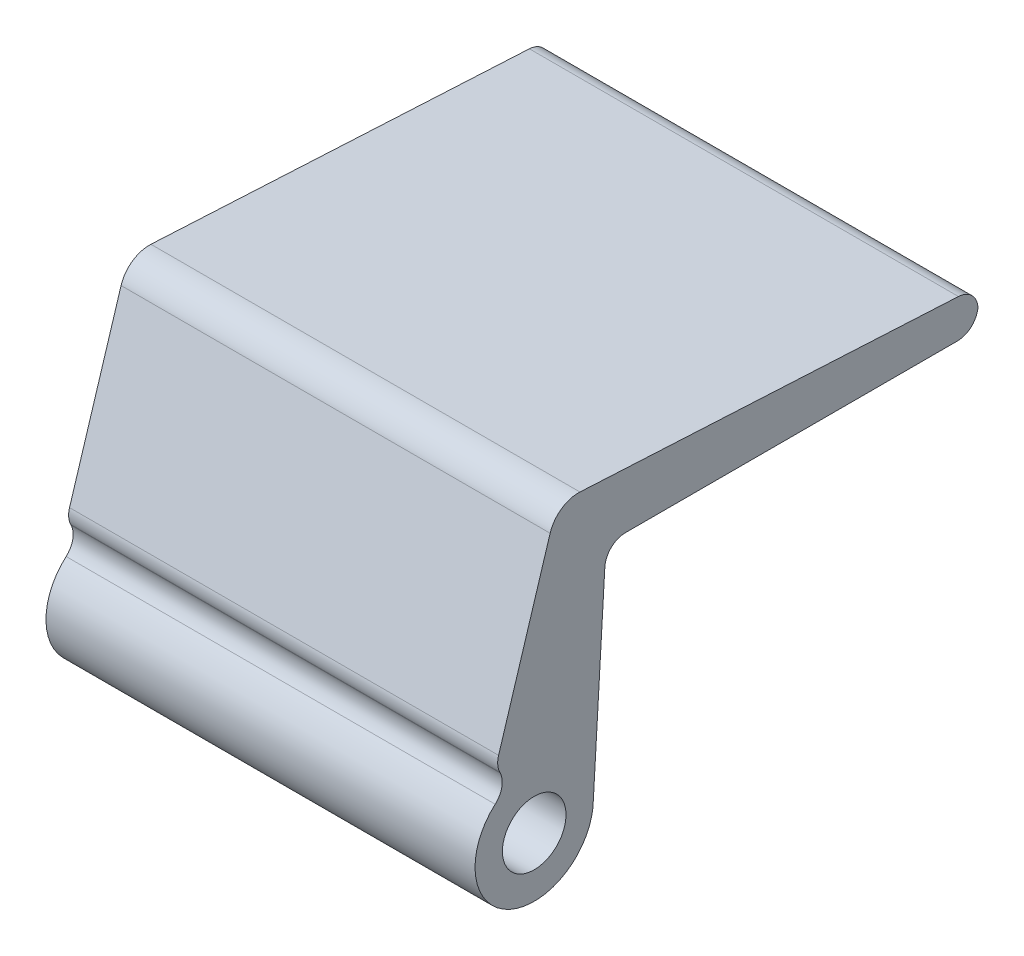
ISO-10303-21;
HEADER;
FILE_DESCRIPTION(('STEP AP214'),'2;1');
FILE_NAME('part.step','',(''),(''),'','','');
FILE_SCHEMA(('AUTOMOTIVE_DESIGN { 1 0 10303 214 1 1 1 1 }'));
ENDSEC;
DATA;
#1=APPLICATION_CONTEXT('core data for automotive mechanical design processes');
#2=APPLICATION_PROTOCOL_DEFINITION('international standard','automotive_design',2000,#1);
#3=PRODUCT_CONTEXT('',#1,'mechanical');
#4=PRODUCT('Part','Part','',(#3));
#5=PRODUCT_RELATED_PRODUCT_CATEGORY('part','',(#4));
#6=PRODUCT_DEFINITION_FORMATION('','',#4);
#7=PRODUCT_DEFINITION_CONTEXT('part definition',#1,'design');
#8=PRODUCT_DEFINITION('design','',#6,#7);
#9=PRODUCT_DEFINITION_SHAPE('','',#8);
#10=(LENGTH_UNIT() NAMED_UNIT(*) SI_UNIT(.MILLI.,.METRE.));
#11=(NAMED_UNIT(*) PLANE_ANGLE_UNIT() SI_UNIT($,.RADIAN.));
#12=(NAMED_UNIT(*) SI_UNIT($,.STERADIAN.) SOLID_ANGLE_UNIT());
#13=UNCERTAINTY_MEASURE_WITH_UNIT(LENGTH_MEASURE(1.E-05),#10,'distance_accuracy_value','');
#14=(GEOMETRIC_REPRESENTATION_CONTEXT(3) GLOBAL_UNCERTAINTY_ASSIGNED_CONTEXT((#13)) GLOBAL_UNIT_ASSIGNED_CONTEXT((#10,
#11,#12)) REPRESENTATION_CONTEXT('',''));
#15=CARTESIAN_POINT('',(0.,0.,0.));
#16=DIRECTION('',(0.,0.,1.));
#17=DIRECTION('',(1.,0.,0.));
#18=AXIS2_PLACEMENT_3D('',#15,#16,#17);
#19=CARTESIAN_POINT('',(14.5,0.,0.));
#20=DIRECTION('',(1.,0.,0.));
#21=DIRECTION('',(0.,0.,-1.));
#22=AXIS2_PLACEMENT_3D('',#19,#20,#21);
#23=PLANE('',#22);
#24=DIRECTION('',(0.,-0.955332455680298,0.295533245378336));
#25=VECTOR('',#24,1.);
#26=CARTESIAN_POINT('',(14.5,18.5000000012756,-1.53597319386404));
#27=LINE('',#26,#25);
#28=CARTESIAN_POINT('',(14.5,17.0118628642919,-1.07561617883135));
#29=VERTEX_POINT('',#28);
#30=CARTESIAN_POINT('',(14.5,5.75246638641333,2.40749167783547));
#31=VERTEX_POINT('',#30);
#32=EDGE_CURVE('E235',#29,#31,#27,.T.);
#33=ORIENTED_EDGE('',*,*,#32,.T.);
#34=CARTESIAN_POINT('',(14.5,5.33871984288366,1.07002623988305));
#35=DIRECTION('',(1.,0.,0.));
#36=DIRECTION('',(0.,0.,-1.));
#37=AXIS2_PLACEMENT_3D('',#34,#35,#36);
#38=CIRCLE('',#37,1.4);
#39=CARTESIAN_POINT('',(14.5,4.71989228420667,2.3258337301545));
#40=VERTEX_POINT('',#39);
#41=EDGE_CURVE('E199',#31,#40,#38,.T.);
#42=ORIENTED_EDGE('',*,*,#41,.T.);
#43=DIRECTION('',(0.,-0.89700535019389,-0.442019684769283));
#44=VECTOR('',#43,1.);
#45=CARTESIAN_POINT('',(14.5,5.21992229558675,2.57223483351206));
#46=LINE('',#45,#44);
#47=CARTESIAN_POINT('',(14.5,4.67820754612733,2.30529263217606));
#48=VERTEX_POINT('',#47);
#49=EDGE_CURVE('E136',#40,#48,#46,.T.);
#50=ORIENTED_EDGE('',*,*,#49,.T.);
#51=CARTESIAN_POINT('',(14.5,4.05937998745034,3.56110012244751));
#52=DIRECTION('',(1.,0.,0.));
#53=DIRECTION('',(0.,0.,-1.));
#54=AXIS2_PLACEMENT_3D('',#51,#52,#53);
#55=CIRCLE('',#54,1.4);
#56=CARTESIAN_POINT('',(14.5,3.00694813821342,2.63785194199343));
#57=VERTEX_POINT('',#56);
#58=EDGE_CURVE('E132',#48,#57,#55,.F.);
#59=ORIENTED_EDGE('',*,*,#58,.T.);
#60=CARTESIAN_POINT('',(14.5,0.,0.));
#61=DIRECTION('',(1.,0.,0.));
#62=DIRECTION('',(0.,0.,-1.));
#63=AXIS2_PLACEMENT_3D('',#60,#61,#62);
#64=CIRCLE('',#63,3.99999999672296);
#65=CARTESIAN_POINT('',(14.5,1.27564803060606E-09,-3.99999999672296));
#66=VERTEX_POINT('',#65);
#67=EDGE_CURVE('E123',#57,#66,#64,.T.);
#68=ORIENTED_EDGE('',*,*,#67,.T.);
#69=DIRECTION('',(0.,0.998283074872705,-0.0585739056466016));
#70=VECTOR('',#69,1.);
#71=CARTESIAN_POINT('',(14.5,14.0000000012756,-4.82144503540298));
#72=LINE('',#71,#70);
#73=CARTESIAN_POINT('',(14.5,13.1820034691809,-4.77344937876393));
#74=VERTEX_POINT('',#73);
#75=EDGE_CURVE('E128',#66,#74,#72,.T.);
#76=ORIENTED_EDGE('',*,*,#75,.T.);
#77=CARTESIAN_POINT('',(14.5,13.1000000012756,-6.17104568358572));
#78=DIRECTION('',(1.,0.,0.));
#79=DIRECTION('',(0.,0.,-1.));
#80=AXIS2_PLACEMENT_3D('',#77,#78,#79);
#81=CIRCLE('',#80,1.4);
#82=CARTESIAN_POINT('',(14.5,14.5000000012756,-6.17104568358572));
#83=VERTEX_POINT('',#82);
#84=EDGE_CURVE('E11',#74,#83,#81,.F.);
#85=ORIENTED_EDGE('',*,*,#84,.T.);
#86=DIRECTION('',(0.,0.,-1.));
#87=VECTOR('',#86,1.);
#88=CARTESIAN_POINT('',(14.5,14.5000000012756,-26.5204953852147));
#89=LINE('',#88,#87);
#90=CARTESIAN_POINT('',(14.5,14.5000000012756,-28.600000003277));
#91=VERTEX_POINT('',#90);
#92=EDGE_CURVE('E147',#83,#91,#89,.T.);
#93=ORIENTED_EDGE('',*,*,#92,.T.);
#94=CARTESIAN_POINT('',(14.5,15.9000000012757,-28.600000003277));
#95=DIRECTION('',(1.,0.,0.));
#96=DIRECTION('',(0.,0.,-1.));
#97=AXIS2_PLACEMENT_3D('',#94,#95,#96);
#98=CIRCLE('',#97,1.4);
#99=CARTESIAN_POINT('',(14.5,15.785917360693,-29.9953441010241));
#100=VERTEX_POINT('',#99);
#101=EDGE_CURVE('E49',#91,#100,#98,.T.);
#102=ORIENTED_EDGE('',*,*,#101,.T.);
#103=CARTESIAN_POINT('',(14.5,15.6718347201104,-28.600000003277));
#104=DIRECTION('',(1.,0.,0.));
#105=DIRECTION('',(0.,0.,-1.));
#106=AXIS2_PLACEMENT_3D('',#103,#104,#105);
#107=CIRCLE('',#106,1.4);
#108=CARTESIAN_POINT('',(14.5,17.0698947972005,-28.6736751065812));
#109=VERTEX_POINT('',#108);
#110=EDGE_CURVE('E197',#100,#109,#107,.T.);
#111=ORIENTED_EDGE('',*,*,#110,.T.);
#112=DIRECTION('',(0.,0.0526250737886667,0.99861434077863));
#113=VECTOR('',#112,1.);
#114=CARTESIAN_POINT('',(14.5,17.0000000012756,-30.000000003277));
#115=LINE('',#114,#113);
#116=CARTESIAN_POINT('',(14.5,18.4180250550925,-3.09153123776928));
#117=VERTEX_POINT('',#116);
#118=EDGE_CURVE('E169',#109,#117,#115,.T.);
#119=ORIENTED_EDGE('',*,*,#118,.T.);
#120=CARTESIAN_POINT('',(14.5,16.4207963735352,-2.98628109019195));
#121=DIRECTION('',(1.,0.,0.));
#122=DIRECTION('',(0.,0.,-1.));
#123=AXIS2_PLACEMENT_3D('',#120,#121,#122);
#124=CIRCLE('',#123,2.);
#125=EDGE_CURVE('E179',#117,#29,#124,.T.);
#126=ORIENTED_EDGE('',*,*,#125,.T.);
#127=EDGE_LOOP('',(#33,#42,#50,#59,#68,#76,#85,#93,#102,#111,#119,#126));
#128=FACE_BOUND('',#127,.T.);
#129=CARTESIAN_POINT('',(14.5,0.,0.));
#130=DIRECTION('',(1.,0.,0.));
#131=DIRECTION('',(0.,0.,-1.));
#132=AXIS2_PLACEMENT_3D('',#129,#130,#131);
#133=CIRCLE('',#132,2.15);
#134=CARTESIAN_POINT('',(14.5,0.,2.15));
#135=VERTEX_POINT('',#134);
#136=EDGE_CURVE('E159',#135,#135,#133,.T.);
#137=ORIENTED_EDGE('',*,*,#136,.F.);
#138=EDGE_LOOP('',(#137));
#139=FACE_BOUND('',#138,.T.);
#140=ADVANCED_FACE('F33',(#128,#139),#23,.T.);
#141=CARTESIAN_POINT('',(-14.5,0.,0.));
#142=DIRECTION('',(1.,0.,0.));
#143=DIRECTION('',(0.,0.,-1.));
#144=AXIS2_PLACEMENT_3D('',#141,#142,#143);
#145=PLANE('',#144);
#146=DIRECTION('',(0.,-0.89700535019389,-0.442019684769283));
#147=VECTOR('',#146,1.);
#148=CARTESIAN_POINT('',(-14.5,5.21992229558675,2.57223483351206));
#149=LINE('',#148,#147);
#150=CARTESIAN_POINT('',(-14.5,4.71989228420667,2.3258337301545));
#151=VERTEX_POINT('',#150);
#152=CARTESIAN_POINT('',(-14.5,4.67820754612733,2.30529263217606));
#153=VERTEX_POINT('',#152);
#154=EDGE_CURVE('E162',#151,#153,#149,.T.);
#155=ORIENTED_EDGE('',*,*,#154,.F.);
#156=CARTESIAN_POINT('',(-14.5,5.33871984288366,1.07002623988305));
#157=DIRECTION('',(1.,0.,0.));
#158=DIRECTION('',(0.,0.,-1.));
#159=AXIS2_PLACEMENT_3D('',#156,#157,#158);
#160=CIRCLE('',#159,1.4);
#161=CARTESIAN_POINT('',(-14.5,5.75246638641333,2.40749167783547));
#162=VERTEX_POINT('',#161);
#163=EDGE_CURVE('E192',#151,#162,#160,.F.);
#164=ORIENTED_EDGE('',*,*,#163,.T.);
#165=DIRECTION('',(0.,-0.955332455680298,0.295533245378336));
#166=VECTOR('',#165,1.);
#167=CARTESIAN_POINT('',(-14.5,18.5000000012756,-1.53597319386404));
#168=LINE('',#167,#166);
#169=CARTESIAN_POINT('',(-14.5,17.0118628642919,-1.07561617883135));
#170=VERTEX_POINT('',#169);
#171=EDGE_CURVE('E158',#170,#162,#168,.T.);
#172=ORIENTED_EDGE('',*,*,#171,.F.);
#173=CARTESIAN_POINT('',(-14.5,16.4207963735352,-2.98628109019195));
#174=DIRECTION('',(1.,0.,0.));
#175=DIRECTION('',(0.,0.,-1.));
#176=AXIS2_PLACEMENT_3D('',#173,#174,#175);
#177=CIRCLE('',#176,2.);
#178=CARTESIAN_POINT('',(-14.5,18.4180250550925,-3.09153123776928));
#179=VERTEX_POINT('',#178);
#180=EDGE_CURVE('E173',#170,#179,#177,.F.);
#181=ORIENTED_EDGE('',*,*,#180,.T.);
#182=DIRECTION('',(0.,0.0526250737886667,0.99861434077863));
#183=VECTOR('',#182,1.);
#184=CARTESIAN_POINT('',(-14.5,17.0000000012756,-30.000000003277));
#185=LINE('',#184,#183);
#186=CARTESIAN_POINT('',(-14.5,17.0698947972005,-28.6736751065812));
#187=VERTEX_POINT('',#186);
#188=EDGE_CURVE('E156',#187,#179,#185,.T.);
#189=ORIENTED_EDGE('',*,*,#188,.F.);
#190=CARTESIAN_POINT('',(-14.5,15.6718347201104,-28.600000003277));
#191=DIRECTION('',(1.,0.,0.));
#192=DIRECTION('',(0.,0.,-1.));
#193=AXIS2_PLACEMENT_3D('',#190,#191,#192);
#194=CIRCLE('',#193,1.4);
#195=CARTESIAN_POINT('',(-14.5,15.785917360693,-29.9953441010241));
#196=VERTEX_POINT('',#195);
#197=EDGE_CURVE('E190',#187,#196,#194,.F.);
#198=ORIENTED_EDGE('',*,*,#197,.T.);
#199=CARTESIAN_POINT('',(-14.5,15.9000000012757,-28.600000003277));
#200=DIRECTION('',(1.,0.,0.));
#201=DIRECTION('',(0.,0.,-1.));
#202=AXIS2_PLACEMENT_3D('',#199,#200,#201);
#203=CIRCLE('',#202,1.4);
#204=CARTESIAN_POINT('',(-14.5,14.5000000012756,-28.600000003277));
#205=VERTEX_POINT('',#204);
#206=EDGE_CURVE('E188',#196,#205,#203,.F.);
#207=ORIENTED_EDGE('',*,*,#206,.T.);
#208=DIRECTION('',(0.,0.,-1.));
#209=VECTOR('',#208,1.);
#210=CARTESIAN_POINT('',(-14.5,14.5000000012756,-26.5204953852147));
#211=LINE('',#210,#209);
#212=CARTESIAN_POINT('',(-14.5,14.5000000012756,-6.17104568358573));
#213=VERTEX_POINT('',#212);
#214=EDGE_CURVE('E168',#213,#205,#211,.T.);
#215=ORIENTED_EDGE('',*,*,#214,.F.);
#216=CARTESIAN_POINT('',(-14.5,13.1000000012756,-6.17104568358572));
#217=DIRECTION('',(1.,0.,0.));
#218=DIRECTION('',(0.,0.,-1.));
#219=AXIS2_PLACEMENT_3D('',#216,#217,#218);
#220=CIRCLE('',#219,1.4);
#221=CARTESIAN_POINT('',(-14.5,13.1820034691809,-4.77344937876393));
#222=VERTEX_POINT('',#221);
#223=EDGE_CURVE('E42',#213,#222,#220,.T.);
#224=ORIENTED_EDGE('',*,*,#223,.T.);
#225=DIRECTION('',(0.,0.998283074872705,-0.0585739056466016));
#226=VECTOR('',#225,1.);
#227=CARTESIAN_POINT('',(-14.5,14.0000000012756,-4.82144503540298));
#228=LINE('',#227,#226);
#229=CARTESIAN_POINT('',(-14.5,1.27564803060606E-09,-3.99999999672296));
#230=VERTEX_POINT('',#229);
#231=EDGE_CURVE('E166',#230,#222,#228,.T.);
#232=ORIENTED_EDGE('',*,*,#231,.F.);
#233=CARTESIAN_POINT('',(-14.5,0.,0.));
#234=DIRECTION('',(1.,0.,0.));
#235=DIRECTION('',(0.,0.,-1.));
#236=AXIS2_PLACEMENT_3D('',#233,#234,#235);
#237=CIRCLE('',#236,3.99999999672296);
#238=CARTESIAN_POINT('',(-14.5,3.00694813821342,2.63785194199343));
#239=VERTEX_POINT('',#238);
#240=EDGE_CURVE('E142',#239,#230,#237,.T.);
#241=ORIENTED_EDGE('',*,*,#240,.F.);
#242=CARTESIAN_POINT('',(-14.5,4.05937998745034,3.56110012244751));
#243=DIRECTION('',(1.,0.,0.));
#244=DIRECTION('',(0.,0.,-1.));
#245=AXIS2_PLACEMENT_3D('',#242,#243,#244);
#246=CIRCLE('',#245,1.4);
#247=EDGE_CURVE('E209',#239,#153,#246,.T.);
#248=ORIENTED_EDGE('',*,*,#247,.T.);
#249=EDGE_LOOP('',(#155,#164,#172,#181,#189,#198,#207,#215,#224,#232,#241,#248));
#250=FACE_BOUND('',#249,.T.);
#251=CARTESIAN_POINT('',(-14.5,0.,0.));
#252=DIRECTION('',(1.,0.,0.));
#253=DIRECTION('',(0.,0.,-1.));
#254=AXIS2_PLACEMENT_3D('',#251,#252,#253);
#255=CIRCLE('',#254,2.15);
#256=CARTESIAN_POINT('',(-14.5,0.,2.15));
#257=VERTEX_POINT('',#256);
#258=EDGE_CURVE('E226',#257,#257,#255,.T.);
#259=ORIENTED_EDGE('',*,*,#258,.T.);
#260=EDGE_LOOP('',(#259));
#261=FACE_BOUND('',#260,.T.);
#262=ADVANCED_FACE('F215',(#250,#261),#145,.F.);
#263=CARTESIAN_POINT('',(14.5,17.0000000012756,-30.000000003277));
#264=DIRECTION('',(0.,-0.99861434077863,0.0526250737886667));
#265=DIRECTION('',(0.,-0.0526250737886667,-0.99861434077863));
#266=AXIS2_PLACEMENT_3D('',#263,#264,#265);
#267=PLANE('',#266);
#268=ORIENTED_EDGE('',*,*,#118,.F.);
#269=DIRECTION('',(-1.,0.,0.));
#270=VECTOR('',#269,1.);
#271=CARTESIAN_POINT('',(14.5,17.0698947972005,-28.6736751065812));
#272=LINE('',#271,#270);
#273=EDGE_CURVE('E201',#109,#187,#272,.T.);
#274=ORIENTED_EDGE('',*,*,#273,.T.);
#275=ORIENTED_EDGE('',*,*,#188,.T.);
#276=DIRECTION('',(-1.,0.,0.));
#277=VECTOR('',#276,1.);
#278=CARTESIAN_POINT('',(14.5,18.4180250550925,-3.09153123776928));
#279=LINE('',#278,#277);
#280=EDGE_CURVE('E176',#179,#117,#279,.F.);
#281=ORIENTED_EDGE('',*,*,#280,.T.);
#282=EDGE_LOOP('',(#268,#274,#275,#281));
#283=FACE_BOUND('',#282,.T.);
#284=ADVANCED_FACE('F231',(#283),#267,.F.);
#285=CARTESIAN_POINT('',(14.5,18.5000000012756,-1.53597319386404));
#286=DIRECTION('',(0.,-0.295533245378336,-0.955332455680298));
#287=DIRECTION('',(0.,0.955332455680298,-0.295533245378336));
#288=AXIS2_PLACEMENT_3D('',#285,#286,#287);
#289=PLANE('',#288);
#290=ORIENTED_EDGE('',*,*,#171,.T.);
#291=DIRECTION('',(-1.,0.,0.));
#292=VECTOR('',#291,1.);
#293=CARTESIAN_POINT('',(14.5,5.75246638641334,2.40749167783547));
#294=LINE('',#293,#292);
#295=EDGE_CURVE('E194',#162,#31,#294,.F.);
#296=ORIENTED_EDGE('',*,*,#295,.T.);
#297=ORIENTED_EDGE('',*,*,#32,.F.);
#298=DIRECTION('',(-1.,0.,0.));
#299=VECTOR('',#298,1.);
#300=CARTESIAN_POINT('',(14.5,17.0118628642919,-1.07561617883135));
#301=LINE('',#300,#299);
#302=EDGE_CURVE('E146',#29,#170,#301,.T.);
#303=ORIENTED_EDGE('',*,*,#302,.T.);
#304=EDGE_LOOP('',(#290,#296,#297,#303));
#305=FACE_BOUND('',#304,.T.);
#306=ADVANCED_FACE('F253',(#305),#289,.F.);
#307=CARTESIAN_POINT('',(14.5,5.21992229558675,2.57223483351206));
#308=DIRECTION('',(0.,0.442019684769283,-0.89700535019389));
#309=DIRECTION('',(0.,0.89700535019389,0.442019684769283));
#310=AXIS2_PLACEMENT_3D('',#307,#308,#309);
#311=PLANE('',#310);
#312=ORIENTED_EDGE('',*,*,#154,.T.);
#313=DIRECTION('',(1.,0.,0.));
#314=VECTOR('',#313,1.);
#315=CARTESIAN_POINT('',(14.5,4.67820754612733,2.30529263217606));
#316=LINE('',#315,#314);
#317=EDGE_CURVE('E186',#153,#48,#316,.T.);
#318=ORIENTED_EDGE('',*,*,#317,.T.);
#319=ORIENTED_EDGE('',*,*,#49,.F.);
#320=DIRECTION('',(-1.,0.,0.));
#321=VECTOR('',#320,1.);
#322=CARTESIAN_POINT('',(14.5,4.71989228420667,2.3258337301545));
#323=LINE('',#322,#321);
#324=EDGE_CURVE('E183',#40,#151,#323,.T.);
#325=ORIENTED_EDGE('',*,*,#324,.T.);
#326=EDGE_LOOP('',(#312,#318,#319,#325));
#327=FACE_BOUND('',#326,.T.);
#328=ADVANCED_FACE('F247',(#327),#311,.F.);
#329=CARTESIAN_POINT('',(14.5,0.,0.));
#330=DIRECTION('',(-1.,0.,0.));
#331=DIRECTION('',(0.,0.,1.));
#332=AXIS2_PLACEMENT_3D('',#329,#330,#331);
#333=CYLINDRICAL_SURFACE('',#332,3.99999999672296);
#334=ORIENTED_EDGE('',*,*,#67,.F.);
#335=DIRECTION('',(-1.,0.,0.));
#336=VECTOR('',#335,1.);
#337=CARTESIAN_POINT('',(14.5,3.00694813821342,2.63785194199343));
#338=LINE('',#337,#336);
#339=EDGE_CURVE('E181',#57,#239,#338,.T.);
#340=ORIENTED_EDGE('',*,*,#339,.T.);
#341=ORIENTED_EDGE('',*,*,#240,.T.);
#342=DIRECTION('',(-1.,0.,0.));
#343=VECTOR('',#342,1.);
#344=CARTESIAN_POINT('',(14.5,1.27564803060606E-09,-3.99999999672296));
#345=LINE('',#344,#343);
#346=EDGE_CURVE('E139',#66,#230,#345,.T.);
#347=ORIENTED_EDGE('',*,*,#346,.F.);
#348=EDGE_LOOP('',(#334,#340,#341,#347));
#349=FACE_BOUND('',#348,.T.);
#350=ADVANCED_FACE('F140',(#349),#333,.T.);
#351=CARTESIAN_POINT('',(14.5,14.0000000012756,-4.82144503540298));
#352=DIRECTION('',(0.,0.0585739056466016,0.998283074872705));
#353=DIRECTION('',(0.,-0.998283074872705,0.0585739056466016));
#354=AXIS2_PLACEMENT_3D('',#351,#352,#353);
#355=PLANE('',#354);
#356=ORIENTED_EDGE('',*,*,#231,.T.);
#357=DIRECTION('',(-1.,0.,0.));
#358=VECTOR('',#357,1.);
#359=CARTESIAN_POINT('',(14.5,13.1820034691809,-4.77344937876393));
#360=LINE('',#359,#358);
#361=EDGE_CURVE('E151',#222,#74,#360,.F.);
#362=ORIENTED_EDGE('',*,*,#361,.T.);
#363=ORIENTED_EDGE('',*,*,#75,.F.);
#364=ORIENTED_EDGE('',*,*,#346,.T.);
#365=EDGE_LOOP('',(#356,#362,#363,#364));
#366=FACE_BOUND('',#365,.T.);
#367=ADVANCED_FACE('F149',(#366),#355,.F.);
#368=CARTESIAN_POINT('',(14.5,14.5000000012756,-26.5204953852147));
#369=DIRECTION('',(0.,1.,0.));
#370=DIRECTION('',(0.,0.,1.));
#371=AXIS2_PLACEMENT_3D('',#368,#369,#370);
#372=PLANE('',#371);
#373=ORIENTED_EDGE('',*,*,#214,.T.);
#374=DIRECTION('',(-1.,0.,0.));
#375=VECTOR('',#374,1.);
#376=CARTESIAN_POINT('',(14.5,14.5000000012756,-28.600000003277));
#377=LINE('',#376,#375);
#378=EDGE_CURVE('E57',#205,#91,#377,.F.);
#379=ORIENTED_EDGE('',*,*,#378,.T.);
#380=ORIENTED_EDGE('',*,*,#92,.F.);
#381=DIRECTION('',(-1.,0.,0.));
#382=VECTOR('',#381,1.);
#383=CARTESIAN_POINT('',(-14.5,14.5000000012756,-6.17104568358572));
#384=LINE('',#383,#382);
#385=EDGE_CURVE('E204',#83,#213,#384,.T.);
#386=ORIENTED_EDGE('',*,*,#385,.T.);
#387=EDGE_LOOP('',(#373,#379,#380,#386));
#388=FACE_BOUND('',#387,.T.);
#389=ADVANCED_FACE('F219',(#388),#372,.F.);
#390=CARTESIAN_POINT('',(14.5,0.,0.));
#391=DIRECTION('',(-1.,0.,0.));
#392=DIRECTION('',(0.,0.,1.));
#393=AXIS2_PLACEMENT_3D('',#390,#391,#392);
#394=CYLINDRICAL_SURFACE('',#393,2.15);
#395=CARTESIAN_POINT('',(14.5,0.,2.15));
#396=CARTESIAN_POINT('',(14.1979166666667,0.,2.15));
#397=CARTESIAN_POINT('',(13.8958333333333,0.,2.15));
#398=CARTESIAN_POINT('',(13.2916666666667,0.,2.15));
#399=CARTESIAN_POINT('',(12.9895833333333,0.,2.15));
#400=CARTESIAN_POINT('',(12.3854166666667,0.,2.15));
#401=CARTESIAN_POINT('',(12.0833333333333,0.,2.15));
#402=CARTESIAN_POINT('',(11.4791666666667,0.,2.15));
#403=CARTESIAN_POINT('',(11.1770833333333,0.,2.15));
#404=CARTESIAN_POINT('',(10.5729166666667,0.,2.15));
#405=CARTESIAN_POINT('',(10.2708333333333,0.,2.15));
#406=CARTESIAN_POINT('',(9.66666666666667,0.,2.15));
#407=CARTESIAN_POINT('',(9.36458333333333,0.,2.15));
#408=CARTESIAN_POINT('',(8.76041666666667,0.,2.15));
#409=CARTESIAN_POINT('',(8.45833333333333,0.,2.15));
#410=CARTESIAN_POINT('',(7.85416666666667,0.,2.15));
#411=CARTESIAN_POINT('',(7.55208333333333,0.,2.15));
#412=CARTESIAN_POINT('',(6.94791666666667,0.,2.15));
#413=CARTESIAN_POINT('',(6.64583333333333,0.,2.15));
#414=CARTESIAN_POINT('',(6.04166666666667,0.,2.15));
#415=CARTESIAN_POINT('',(5.73958333333333,0.,2.15));
#416=CARTESIAN_POINT('',(5.13541666666667,0.,2.15));
#417=CARTESIAN_POINT('',(4.83333333333333,0.,2.15));
#418=CARTESIAN_POINT('',(4.22916666666667,0.,2.15));
#419=CARTESIAN_POINT('',(3.92708333333333,0.,2.15));
#420=CARTESIAN_POINT('',(3.32291666666667,0.,2.15));
#421=CARTESIAN_POINT('',(3.02083333333333,0.,2.15));
#422=CARTESIAN_POINT('',(2.41666666666667,0.,2.15));
#423=CARTESIAN_POINT('',(2.11458333333333,0.,2.15));
#424=CARTESIAN_POINT('',(1.51041666666667,0.,2.15));
#425=CARTESIAN_POINT('',(1.20833333333333,0.,2.15));
#426=CARTESIAN_POINT('',(0.604166666666665,0.,2.15));
#427=CARTESIAN_POINT('',(0.302083333333332,0.,2.15));
#428=CARTESIAN_POINT('',(-0.302083333333335,0.,2.15));
#429=CARTESIAN_POINT('',(-0.604166666666669,0.,2.15));
#430=CARTESIAN_POINT('',(-1.20833333333333,0.,2.15));
#431=CARTESIAN_POINT('',(-1.51041666666667,0.,2.15));
#432=CARTESIAN_POINT('',(-2.11458333333333,0.,2.15));
#433=CARTESIAN_POINT('',(-2.41666666666667,0.,2.15));
#434=CARTESIAN_POINT('',(-3.02083333333333,0.,2.15));
#435=CARTESIAN_POINT('',(-3.32291666666666,0.,2.15));
#436=CARTESIAN_POINT('',(-3.92708333333333,0.,2.15));
#437=CARTESIAN_POINT('',(-4.22916666666667,0.,2.15));
#438=CARTESIAN_POINT('',(-4.83333333333333,0.,2.15));
#439=CARTESIAN_POINT('',(-5.13541666666667,0.,2.15));
#440=CARTESIAN_POINT('',(-5.73958333333333,0.,2.15));
#441=CARTESIAN_POINT('',(-6.04166666666667,0.,2.15));
#442=CARTESIAN_POINT('',(-6.64583333333333,0.,2.15));
#443=CARTESIAN_POINT('',(-6.94791666666667,0.,2.15));
#444=CARTESIAN_POINT('',(-7.55208333333333,0.,2.15));
#445=CARTESIAN_POINT('',(-7.85416666666667,0.,2.15));
#446=CARTESIAN_POINT('',(-8.45833333333333,0.,2.15));
#447=CARTESIAN_POINT('',(-8.76041666666667,0.,2.15));
#448=CARTESIAN_POINT('',(-9.36458333333333,0.,2.15));
#449=CARTESIAN_POINT('',(-9.66666666666667,0.,2.15));
#450=CARTESIAN_POINT('',(-10.2708333333333,0.,2.15));
#451=CARTESIAN_POINT('',(-10.5729166666667,0.,2.15));
#452=CARTESIAN_POINT('',(-11.1770833333333,0.,2.15));
#453=CARTESIAN_POINT('',(-11.4791666666667,0.,2.15));
#454=CARTESIAN_POINT('',(-12.0833333333333,0.,2.15));
#455=CARTESIAN_POINT('',(-12.3854166666667,0.,2.15));
#456=CARTESIAN_POINT('',(-12.9895833333333,0.,2.15));
#457=CARTESIAN_POINT('',(-13.2916666666667,0.,2.15));
#458=CARTESIAN_POINT('',(-13.8958333333333,0.,2.15));
#459=CARTESIAN_POINT('',(-14.1979166666667,0.,2.15));
#460=CARTESIAN_POINT('',(-14.5,0.,2.15));
#461=B_SPLINE_CURVE_WITH_KNOTS('',3,(#395,#396,#397,#398,#399,#400,#401,#402,#403,#404,#405,
#406,#407,#408,#409,#410,#411,#412,#413,#414,#415,#416,#417,#418,#419,#420,#421,#422,#423,#424,
#425,#426,#427,#428,#429,#430,#431,#432,#433,#434,#435,#436,#437,#438,#439,#440,#441,#442,#443,
#444,#445,#446,#447,#448,#449,#450,#451,#452,#453,#454,#455,#456,#457,#458,#459,#460),
.UNSPECIFIED.,.F.,.F.,(4,2,2,2,2,2,2,2,2,2,2,2,2,2,2,2,2,2,2,2,2,2,2,2,2,2,2,2,2,2,2,2,4),(0.,
0.906249999999999,1.8125,2.71875,3.625,4.53125,5.4375,6.34375,7.25,8.15625,9.0625,9.96875,
10.875,11.78125,12.6875,13.59375,14.5,15.40625,16.3125,17.21875,18.125,19.03125,19.9375,
20.84375,21.75,22.65625,23.5625,24.46875,25.375,26.28125,27.1875,28.09375,29.),.UNSPECIFIED.);
#462=EDGE_CURVE('BSEAM259',#135,#257,#461,.T.);
#463=ORIENTED_EDGE('',*,*,#136,.T.);
#464=ORIENTED_EDGE('',*,*,#258,.F.);
#465=ORIENTED_EDGE('',*,*,#462,.T.);
#466=ORIENTED_EDGE('',*,*,#462,.F.);
#467=EDGE_LOOP('',(#463,#465,#464,#466));
#468=FACE_BOUND('',#467,.T.);
#469=ADVANCED_FACE('F259',(#468),#394,.F.);
#470=CARTESIAN_POINT('',(14.5,16.4207963735352,-2.98628109019195));
#471=DIRECTION('',(-1.,0.,0.));
#472=DIRECTION('',(0.,0.,1.));
#473=AXIS2_PLACEMENT_3D('',#470,#471,#472);
#474=CYLINDRICAL_SURFACE('',#473,2.);
#475=ORIENTED_EDGE('',*,*,#125,.F.);
#476=ORIENTED_EDGE('',*,*,#280,.F.);
#477=ORIENTED_EDGE('',*,*,#180,.F.);
#478=ORIENTED_EDGE('',*,*,#302,.F.);
#479=EDGE_LOOP('',(#475,#476,#477,#478));
#480=FACE_BOUND('',#479,.T.);
#481=ADVANCED_FACE('F257',(#480),#474,.T.);
#482=CARTESIAN_POINT('',(14.5,4.05937998745034,3.56110012244751));
#483=DIRECTION('',(-1.,0.,0.));
#484=DIRECTION('',(0.,0.,1.));
#485=AXIS2_PLACEMENT_3D('',#482,#483,#484);
#486=CYLINDRICAL_SURFACE('',#485,1.4);
#487=ORIENTED_EDGE('',*,*,#58,.F.);
#488=ORIENTED_EDGE('',*,*,#317,.F.);
#489=ORIENTED_EDGE('',*,*,#247,.F.);
#490=ORIENTED_EDGE('',*,*,#339,.F.);
#491=EDGE_LOOP('',(#487,#488,#489,#490));
#492=FACE_BOUND('',#491,.T.);
#493=ADVANCED_FACE('F246',(#492),#486,.F.);
#494=CARTESIAN_POINT('',(14.5,5.33871984288366,1.07002623988305));
#495=DIRECTION('',(-1.,0.,0.));
#496=DIRECTION('',(0.,0.,1.));
#497=AXIS2_PLACEMENT_3D('',#494,#495,#496);
#498=CYLINDRICAL_SURFACE('',#497,1.4);
#499=ORIENTED_EDGE('',*,*,#41,.F.);
#500=ORIENTED_EDGE('',*,*,#295,.F.);
#501=ORIENTED_EDGE('',*,*,#163,.F.);
#502=ORIENTED_EDGE('',*,*,#324,.F.);
#503=EDGE_LOOP('',(#499,#500,#501,#502));
#504=FACE_BOUND('',#503,.T.);
#505=ADVANCED_FACE('F249',(#504),#498,.T.);
#506=CARTESIAN_POINT('',(14.5,15.9000000012757,-28.600000003277));
#507=DIRECTION('',(-1.,0.,0.));
#508=DIRECTION('',(0.,0.,1.));
#509=AXIS2_PLACEMENT_3D('',#506,#507,#508);
#510=CYLINDRICAL_SURFACE('',#509,1.4);
#511=DIRECTION('',(-1.,0.,0.));
#512=VECTOR('',#511,1.);
#513=CARTESIAN_POINT('',(0.,15.785917360693,-29.9953441010241));
#514=LINE('',#513,#512);
#515=EDGE_CURVE('E37',#100,#196,#514,.T.);
#516=ORIENTED_EDGE('',*,*,#515,.F.);
#517=ORIENTED_EDGE('',*,*,#101,.F.);
#518=ORIENTED_EDGE('',*,*,#378,.F.);
#519=ORIENTED_EDGE('',*,*,#206,.F.);
#520=EDGE_LOOP('',(#516,#517,#518,#519));
#521=FACE_BOUND('',#520,.T.);
#522=ADVANCED_FACE('F222',(#521),#510,.T.);
#523=CARTESIAN_POINT('',(14.5,15.6718347201104,-28.600000003277));
#524=DIRECTION('',(-1.,0.,0.));
#525=DIRECTION('',(0.,0.,1.));
#526=AXIS2_PLACEMENT_3D('',#523,#524,#525);
#527=CYLINDRICAL_SURFACE('',#526,1.4);
#528=ORIENTED_EDGE('',*,*,#110,.F.);
#529=ORIENTED_EDGE('',*,*,#515,.T.);
#530=ORIENTED_EDGE('',*,*,#197,.F.);
#531=ORIENTED_EDGE('',*,*,#273,.F.);
#532=EDGE_LOOP('',(#528,#529,#530,#531));
#533=FACE_BOUND('',#532,.T.);
#534=ADVANCED_FACE('F228',(#533),#527,.T.);
#535=CARTESIAN_POINT('',(14.5,13.1000000012756,-6.17104568358572));
#536=DIRECTION('',(1.,0.,0.));
#537=DIRECTION('',(0.,0.,-1.));
#538=AXIS2_PLACEMENT_3D('',#535,#536,#537);
#539=CYLINDRICAL_SURFACE('',#538,1.4);
#540=ORIENTED_EDGE('',*,*,#84,.F.);
#541=ORIENTED_EDGE('',*,*,#361,.F.);
#542=ORIENTED_EDGE('',*,*,#223,.F.);
#543=ORIENTED_EDGE('',*,*,#385,.F.);
#544=EDGE_LOOP('',(#540,#541,#542,#543));
#545=FACE_BOUND('',#544,.T.);
#546=ADVANCED_FACE('F35',(#545),#539,.F.);
#547=CLOSED_SHELL('',(#140,#262,#284,#306,#328,#350,#367,#389,#469,#481,#493,#505,#522,#534,#546));
#548=MANIFOLD_SOLID_BREP('B2',#547);
#549=ADVANCED_BREP_SHAPE_REPRESENTATION('',(#18,#548),#14);
#550=SHAPE_DEFINITION_REPRESENTATION(#9,#549);
ENDSEC;
END-ISO-10303-21;
